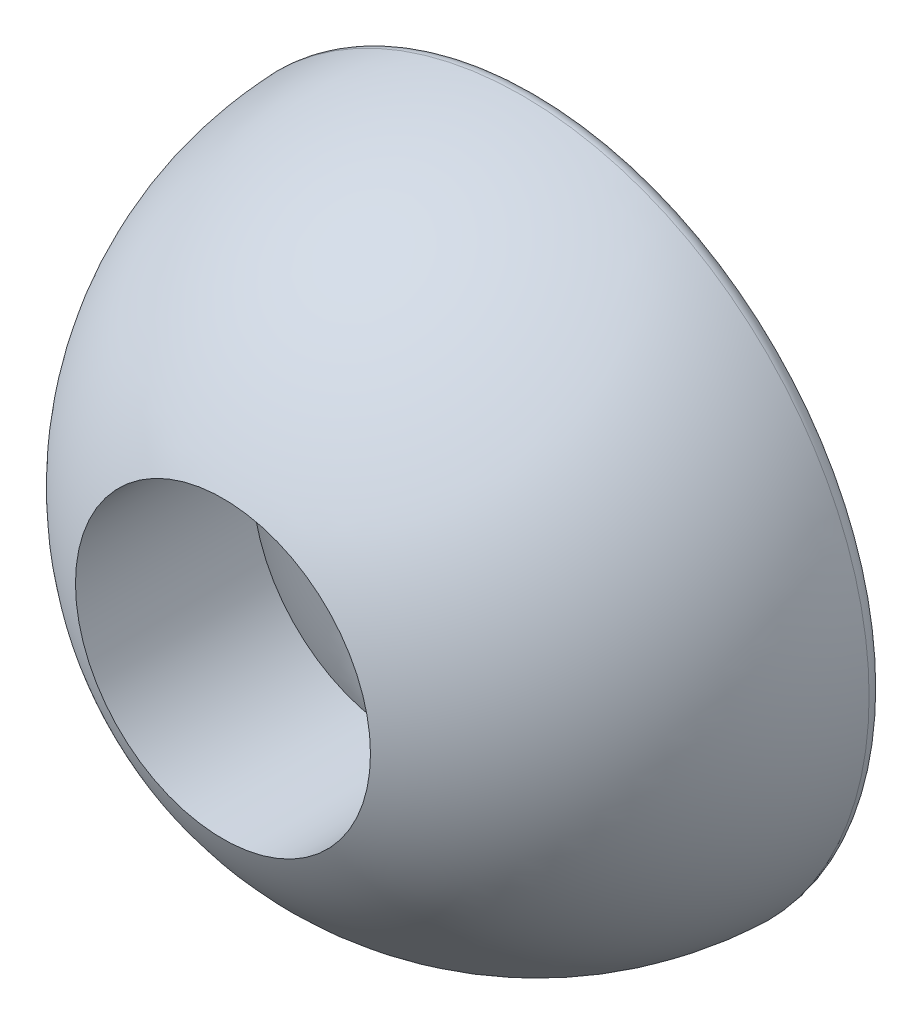
ISO-10303-21;
HEADER;
FILE_DESCRIPTION(('STEP AP214'),'2;1');
FILE_NAME('part.step','',(''),(''),'','','');
FILE_SCHEMA(('AUTOMOTIVE_DESIGN { 1 0 10303 214 1 1 1 1 }'));
ENDSEC;
DATA;
#1=APPLICATION_CONTEXT('core data for automotive mechanical design processes');
#2=APPLICATION_PROTOCOL_DEFINITION('international standard','automotive_design',2000,#1);
#3=PRODUCT_CONTEXT('',#1,'mechanical');
#4=PRODUCT('Part','Part','',(#3));
#5=PRODUCT_RELATED_PRODUCT_CATEGORY('part','',(#4));
#6=PRODUCT_DEFINITION_FORMATION('','',#4);
#7=PRODUCT_DEFINITION_CONTEXT('part definition',#1,'design');
#8=PRODUCT_DEFINITION('design','',#6,#7);
#9=PRODUCT_DEFINITION_SHAPE('','',#8);
#10=(LENGTH_UNIT() NAMED_UNIT(*) SI_UNIT(.MILLI.,.METRE.));
#11=(NAMED_UNIT(*) PLANE_ANGLE_UNIT() SI_UNIT($,.RADIAN.));
#12=(NAMED_UNIT(*) SI_UNIT($,.STERADIAN.) SOLID_ANGLE_UNIT());
#13=UNCERTAINTY_MEASURE_WITH_UNIT(LENGTH_MEASURE(1.E-05),#10,'distance_accuracy_value','');
#14=(GEOMETRIC_REPRESENTATION_CONTEXT(3) GLOBAL_UNCERTAINTY_ASSIGNED_CONTEXT((#13)) GLOBAL_UNIT_ASSIGNED_CONTEXT((#10,
#11,#12)) REPRESENTATION_CONTEXT('',''));
#15=CARTESIAN_POINT('',(0.,0.,0.));
#16=DIRECTION('',(0.,0.,1.));
#17=DIRECTION('',(1.,0.,0.));
#18=AXIS2_PLACEMENT_3D('',#15,#16,#17);
#19=CARTESIAN_POINT('',(0.,0.,0.));
#20=DIRECTION('',(0.,0.,-1.));
#21=DIRECTION('',(1.,0.,0.));
#22=AXIS2_PLACEMENT_3D('',#19,#20,#21);
#23=SPHERICAL_SURFACE('',#22,5.6);
#24=CARTESIAN_POINT('',(0.,0.,0.373333333333333));
#25=DIRECTION('',(0.,0.,-1.));
#26=DIRECTION('',(-1.,0.,0.));
#27=AXIS2_PLACEMENT_3D('',#24,#25,#26);
#28=CIRCLE('',#27,5.58754169758242);
#29=CARTESIAN_POINT('',(-5.58754169758242,0.,0.373333333333333));
#30=VERTEX_POINT('',#29);
#31=EDGE_CURVE('E10',#30,#30,#28,.T.);
#32=ORIENTED_EDGE('',*,*,#31,.T.);
#33=EDGE_LOOP('',(#32));
#34=FACE_BOUND('',#33,.T.);
#35=CARTESIAN_POINT('',(0.,0.,3.81444622455213));
#36=DIRECTION('',(0.,0.,-1.));
#37=DIRECTION('',(-1.,0.,0.));
#38=AXIS2_PLACEMENT_3D('',#35,#36,#37);
#39=CIRCLE('',#38,4.1);
#40=CARTESIAN_POINT('',(-4.1,0.,3.81444622455213));
#41=VERTEX_POINT('',#40);
#42=EDGE_CURVE('E50',#41,#41,#39,.T.);
#43=ORIENTED_EDGE('',*,*,#42,.F.);
#44=EDGE_LOOP('',(#43));
#45=FACE_BOUND('',#44,.T.);
#46=ADVANCED_FACE('F30',(#34,#45),#23,.F.);
#47=CARTESIAN_POINT('',(0.,0.,0.));
#48=DIRECTION('',(0.,0.,-1.));
#49=DIRECTION('',(-1.,0.,0.));
#50=AXIS2_PLACEMENT_3D('',#47,#48,#49);
#51=CYLINDRICAL_SURFACE('',#50,4.1);
#52=CARTESIAN_POINT('',(0.,0.,8.73570260482807));
#53=DIRECTION('',(0.,0.,-1.));
#54=DIRECTION('',(-1.,0.,0.));
#55=AXIS2_PLACEMENT_3D('',#52,#53,#54);
#56=CIRCLE('',#55,4.1);
#57=CARTESIAN_POINT('',(-4.1,0.,8.73570260482807));
#58=VERTEX_POINT('',#57);
#59=EDGE_CURVE('E53',#58,#58,#56,.T.);
#60=ORIENTED_EDGE('',*,*,#59,.F.);
#61=EDGE_LOOP('',(#60));
#62=FACE_BOUND('',#61,.T.);
#63=ORIENTED_EDGE('',*,*,#42,.T.);
#64=EDGE_LOOP('',(#63));
#65=FACE_BOUND('',#64,.T.);
#66=ADVANCED_FACE('F59',(#62,#65),#51,.F.);
#67=CARTESIAN_POINT('',(0.,0.,0.));
#68=DIRECTION('',(0.,0.,-1.));
#69=DIRECTION('',(1.,0.,0.));
#70=AXIS2_PLACEMENT_3D('',#67,#68,#69);
#71=SPHERICAL_SURFACE('',#70,9.65);
#72=CARTESIAN_POINT('',(0.,0.,0.417297297297297));
#73=DIRECTION('',(0.,0.,-1.));
#74=DIRECTION('',(-1.,0.,0.));
#75=AXIS2_PLACEMENT_3D('',#72,#73,#74);
#76=CIRCLE('',#75,9.64097313374891);
#77=CARTESIAN_POINT('',(-9.64097313374891,0.,0.417297297297297));
#78=VERTEX_POINT('',#77);
#79=EDGE_CURVE('E37',#78,#78,#76,.F.);
#80=ORIENTED_EDGE('',*,*,#79,.T.);
#81=EDGE_LOOP('',(#80));
#82=FACE_BOUND('',#81,.T.);
#83=ORIENTED_EDGE('',*,*,#59,.T.);
#84=EDGE_LOOP('',(#83));
#85=FACE_BOUND('',#84,.T.);
#86=ADVANCED_FACE('F57',(#82,#85),#71,.T.);
#87=CARTESIAN_POINT('',(5.6,0.,0.));
#88=DIRECTION('',(0.,0.,1.));
#89=DIRECTION('',(1.,0.,0.));
#90=AXIS2_PLACEMENT_3D('',#87,#88,#89);
#91=PLANE('',#90);
#92=CARTESIAN_POINT('',(0.,0.,0.));
#93=DIRECTION('',(0.,0.,1.));
#94=DIRECTION('',(1.,0.,0.));
#95=AXIS2_PLACEMENT_3D('',#92,#93,#94);
#96=CIRCLE('',#95,9.24134730437072);
#97=CARTESIAN_POINT('',(9.24134730437072,0.,0.));
#98=VERTEX_POINT('',#97);
#99=EDGE_CURVE('E41',#98,#98,#96,.F.);
#100=ORIENTED_EDGE('',*,*,#99,.T.);
#101=EDGE_LOOP('',(#100));
#102=FACE_BOUND('',#101,.T.);
#103=CARTESIAN_POINT('',(0.,0.,0.));
#104=DIRECTION('',(0.,0.,1.));
#105=DIRECTION('',(1.,0.,0.));
#106=AXIS2_PLACEMENT_3D('',#103,#104,#105);
#107=CIRCLE('',#106,5.98665181883831);
#108=CARTESIAN_POINT('',(5.98665181883831,0.,0.));
#109=VERTEX_POINT('',#108);
#110=EDGE_CURVE('E45',#109,#109,#107,.T.);
#111=ORIENTED_EDGE('',*,*,#110,.T.);
#112=EDGE_LOOP('',(#111));
#113=FACE_BOUND('',#112,.T.);
#114=ADVANCED_FACE('F72',(#102,#113),#91,.F.);
#115=CARTESIAN_POINT('',(0.,0.,0.4));
#116=DIRECTION('',(0.,0.,1.));
#117=DIRECTION('',(1.,0.,0.));
#118=AXIS2_PLACEMENT_3D('',#115,#116,#117);
#119=TOROIDAL_SURFACE('',#118,9.24134730437072,0.4);
#120=ORIENTED_EDGE('',*,*,#79,.F.);
#121=EDGE_LOOP('',(#120));
#122=FACE_BOUND('',#121,.T.);
#123=ORIENTED_EDGE('',*,*,#99,.F.);
#124=EDGE_LOOP('',(#123));
#125=FACE_BOUND('',#124,.T.);
#126=ADVANCED_FACE('F70',(#122,#125),#119,.T.);
#127=CARTESIAN_POINT('',(0.,0.,0.4));
#128=DIRECTION('',(0.,0.,1.));
#129=DIRECTION('',(1.,0.,0.));
#130=AXIS2_PLACEMENT_3D('',#127,#128,#129);
#131=TOROIDAL_SURFACE('',#130,5.98665181883831,0.4);
#132=ORIENTED_EDGE('',*,*,#110,.F.);
#133=EDGE_LOOP('',(#132));
#134=FACE_BOUND('',#133,.T.);
#135=ORIENTED_EDGE('',*,*,#31,.F.);
#136=EDGE_LOOP('',(#135));
#137=FACE_BOUND('',#136,.T.);
#138=ADVANCED_FACE('F32',(#134,#137),#131,.T.);
#139=CLOSED_SHELL('',(#46,#66,#86,#114,#126,#138));
#140=MANIFOLD_SOLID_BREP('B2',#139);
#141=ADVANCED_BREP_SHAPE_REPRESENTATION('',(#18,#140),#14);
#142=SHAPE_DEFINITION_REPRESENTATION(#9,#141);
ENDSEC;
END-ISO-10303-21;
